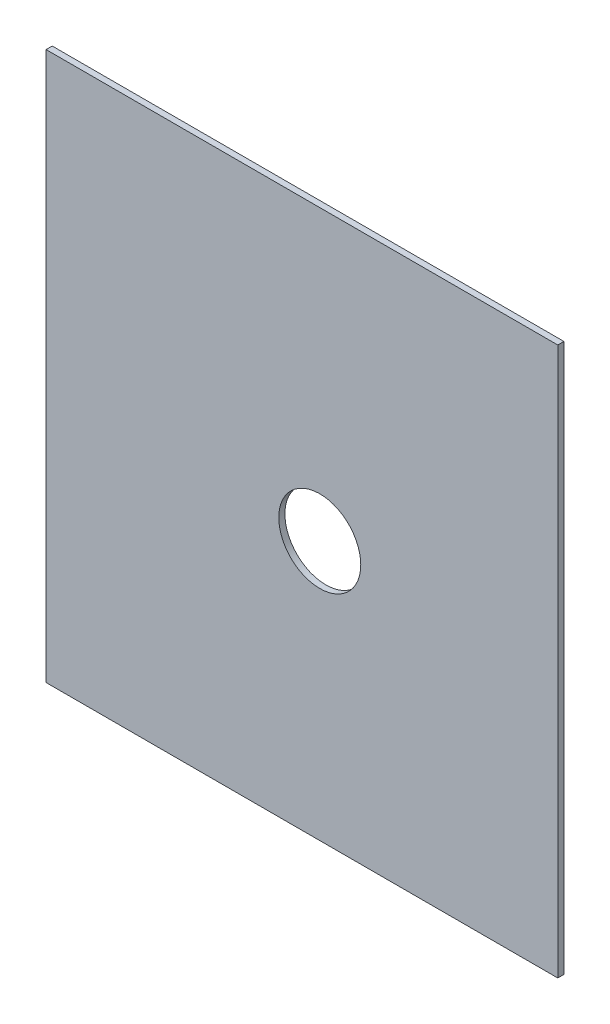
ISO-10303-21;
HEADER;
FILE_DESCRIPTION(('STEP AP214'),'2;1');
FILE_NAME('part.step','',(''),(''),'','','');
FILE_SCHEMA(('AUTOMOTIVE_DESIGN { 1 0 10303 214 1 1 1 1 }'));
ENDSEC;
DATA;
#1=APPLICATION_CONTEXT('core data for automotive mechanical design processes');
#2=APPLICATION_PROTOCOL_DEFINITION('international standard','automotive_design',2000,#1);
#3=PRODUCT_CONTEXT('',#1,'mechanical');
#4=PRODUCT('Part','Part','',(#3));
#5=PRODUCT_RELATED_PRODUCT_CATEGORY('part','',(#4));
#6=PRODUCT_DEFINITION_FORMATION('','',#4);
#7=PRODUCT_DEFINITION_CONTEXT('part definition',#1,'design');
#8=PRODUCT_DEFINITION('design','',#6,#7);
#9=PRODUCT_DEFINITION_SHAPE('','',#8);
#10=(LENGTH_UNIT() NAMED_UNIT(*) SI_UNIT(.MILLI.,.METRE.));
#11=(NAMED_UNIT(*) PLANE_ANGLE_UNIT() SI_UNIT($,.RADIAN.));
#12=(NAMED_UNIT(*) SI_UNIT($,.STERADIAN.) SOLID_ANGLE_UNIT());
#13=UNCERTAINTY_MEASURE_WITH_UNIT(LENGTH_MEASURE(1.E-05),#10,'distance_accuracy_value','');
#14=(GEOMETRIC_REPRESENTATION_CONTEXT(3) GLOBAL_UNCERTAINTY_ASSIGNED_CONTEXT((#13)) GLOBAL_UNIT_ASSIGNED_CONTEXT((#10,
#11,#12)) REPRESENTATION_CONTEXT('',''));
#15=CARTESIAN_POINT('',(0.,0.,0.));
#16=DIRECTION('',(0.,0.,1.));
#17=DIRECTION('',(1.,0.,0.));
#18=AXIS2_PLACEMENT_3D('',#15,#16,#17);
#19=CARTESIAN_POINT('',(0.,0.,3.));
#20=DIRECTION('',(1.,0.,0.));
#21=DIRECTION('',(0.,1.,0.));
#22=AXIS2_PLACEMENT_3D('',#19,#20,#21);
#23=PLANE('',#22);
#24=DIRECTION('',(0.,-1.,0.));
#25=VECTOR('',#24,1.);
#26=CARTESIAN_POINT('',(0.,0.,0.));
#27=LINE('',#26,#25);
#28=CARTESIAN_POINT('',(0.,0.,0.));
#29=VERTEX_POINT('',#28);
#30=CARTESIAN_POINT('',(0.,-267.4,0.));
#31=VERTEX_POINT('',#30);
#32=EDGE_CURVE('E96',#29,#31,#27,.T.);
#33=ORIENTED_EDGE('',*,*,#32,.T.);
#34=DIRECTION('',(0.,0.,-1.));
#35=VECTOR('',#34,1.);
#36=CARTESIAN_POINT('',(0.,-267.4,3.));
#37=LINE('',#36,#35);
#38=CARTESIAN_POINT('',(0.,-267.4,3.));
#39=VERTEX_POINT('',#38);
#40=EDGE_CURVE('E11',#39,#31,#37,.T.);
#41=ORIENTED_EDGE('',*,*,#40,.F.);
#42=DIRECTION('',(0.,-1.,0.));
#43=VECTOR('',#42,1.);
#44=CARTESIAN_POINT('',(0.,0.,3.));
#45=LINE('',#44,#43);
#46=CARTESIAN_POINT('',(0.,0.,3.));
#47=VERTEX_POINT('',#46);
#48=EDGE_CURVE('E84',#47,#39,#45,.T.);
#49=ORIENTED_EDGE('',*,*,#48,.F.);
#50=DIRECTION('',(0.,0.,-1.));
#51=VECTOR('',#50,1.);
#52=CARTESIAN_POINT('',(0.,0.,3.));
#53=LINE('',#52,#51);
#54=EDGE_CURVE('E92',#47,#29,#53,.T.);
#55=ORIENTED_EDGE('',*,*,#54,.T.);
#56=EDGE_LOOP('',(#33,#41,#49,#55));
#57=FACE_BOUND('',#56,.T.);
#58=ADVANCED_FACE('F33',(#57),#23,.F.);
#59=CARTESIAN_POINT('',(0.,-267.4,3.));
#60=DIRECTION('',(0.,1.,0.));
#61=DIRECTION('',(0.,0.,1.));
#62=AXIS2_PLACEMENT_3D('',#59,#60,#61);
#63=PLANE('',#62);
#64=DIRECTION('',(1.,0.,0.));
#65=VECTOR('',#64,1.);
#66=CARTESIAN_POINT('',(0.,-267.4,0.));
#67=LINE('',#66,#65);
#68=CARTESIAN_POINT('',(249.6,-267.4,0.));
#69=VERTEX_POINT('',#68);
#70=EDGE_CURVE('E88',#31,#69,#67,.T.);
#71=ORIENTED_EDGE('',*,*,#70,.T.);
#72=DIRECTION('',(0.,0.,-1.));
#73=VECTOR('',#72,1.);
#74=CARTESIAN_POINT('',(249.6,-267.4,3.));
#75=LINE('',#74,#73);
#76=CARTESIAN_POINT('',(249.6,-267.4,3.));
#77=VERTEX_POINT('',#76);
#78=EDGE_CURVE('E41',#77,#69,#75,.T.);
#79=ORIENTED_EDGE('',*,*,#78,.F.);
#80=DIRECTION('',(1.,0.,0.));
#81=VECTOR('',#80,1.);
#82=CARTESIAN_POINT('',(0.,-267.4,3.));
#83=LINE('',#82,#81);
#84=EDGE_CURVE('E79',#39,#77,#83,.T.);
#85=ORIENTED_EDGE('',*,*,#84,.F.);
#86=ORIENTED_EDGE('',*,*,#40,.T.);
#87=EDGE_LOOP('',(#71,#79,#85,#86));
#88=FACE_BOUND('',#87,.T.);
#89=ADVANCED_FACE('F87',(#88),#63,.F.);
#90=CARTESIAN_POINT('',(249.6,0.,3.));
#91=DIRECTION('',(-1.,0.,0.));
#92=DIRECTION('',(0.,-1.,0.));
#93=AXIS2_PLACEMENT_3D('',#90,#91,#92);
#94=PLANE('',#93);
#95=DIRECTION('',(0.,1.,0.));
#96=VECTOR('',#95,1.);
#97=CARTESIAN_POINT('',(249.6,0.,0.));
#98=LINE('',#97,#96);
#99=CARTESIAN_POINT('',(249.6,0.,0.));
#100=VERTEX_POINT('',#99);
#101=EDGE_CURVE('E66',#69,#100,#98,.T.);
#102=ORIENTED_EDGE('',*,*,#101,.T.);
#103=DIRECTION('',(0.,0.,-1.));
#104=VECTOR('',#103,1.);
#105=CARTESIAN_POINT('',(249.6,0.,3.));
#106=LINE('',#105,#104);
#107=CARTESIAN_POINT('',(249.6,0.,3.));
#108=VERTEX_POINT('',#107);
#109=EDGE_CURVE('E89',#108,#100,#106,.T.);
#110=ORIENTED_EDGE('',*,*,#109,.F.);
#111=DIRECTION('',(0.,1.,0.));
#112=VECTOR('',#111,1.);
#113=CARTESIAN_POINT('',(249.6,0.,3.));
#114=LINE('',#113,#112);
#115=EDGE_CURVE('E82',#77,#108,#114,.T.);
#116=ORIENTED_EDGE('',*,*,#115,.F.);
#117=ORIENTED_EDGE('',*,*,#78,.T.);
#118=EDGE_LOOP('',(#102,#110,#116,#117));
#119=FACE_BOUND('',#118,.T.);
#120=ADVANCED_FACE('F90',(#119),#94,.F.);
#121=CARTESIAN_POINT('',(0.,0.,3.));
#122=DIRECTION('',(0.,-1.,0.));
#123=DIRECTION('',(0.,0.,-1.));
#124=AXIS2_PLACEMENT_3D('',#121,#122,#123);
#125=PLANE('',#124);
#126=DIRECTION('',(-1.,0.,0.));
#127=VECTOR('',#126,1.);
#128=CARTESIAN_POINT('',(0.,0.,0.));
#129=LINE('',#128,#127);
#130=EDGE_CURVE('E72',#100,#29,#129,.T.);
#131=ORIENTED_EDGE('',*,*,#130,.T.);
#132=ORIENTED_EDGE('',*,*,#54,.F.);
#133=DIRECTION('',(-1.,0.,0.));
#134=VECTOR('',#133,1.);
#135=CARTESIAN_POINT('',(0.,0.,3.));
#136=LINE('',#135,#134);
#137=EDGE_CURVE('E49',#108,#47,#136,.T.);
#138=ORIENTED_EDGE('',*,*,#137,.F.);
#139=ORIENTED_EDGE('',*,*,#109,.T.);
#140=EDGE_LOOP('',(#131,#132,#138,#139));
#141=FACE_BOUND('',#140,.T.);
#142=ADVANCED_FACE('F104',(#141),#125,.F.);
#143=CARTESIAN_POINT('',(0.,0.,3.));
#144=DIRECTION('',(0.,0.,1.));
#145=DIRECTION('',(1.,0.,0.));
#146=AXIS2_PLACEMENT_3D('',#143,#144,#145);
#147=PLANE('',#146);
#148=CARTESIAN_POINT('',(133.5,-140.910978413468,3.));
#149=DIRECTION('',(0.,0.,1.));
#150=DIRECTION('',(1.,0.,0.));
#151=AXIS2_PLACEMENT_3D('',#148,#149,#150);
#152=CIRCLE('',#151,20.);
#153=CARTESIAN_POINT('',(153.5,-140.910978413468,3.));
#154=VERTEX_POINT('',#153);
#155=EDGE_CURVE('E110',#154,#154,#152,.T.);
#156=ORIENTED_EDGE('',*,*,#155,.F.);
#157=EDGE_LOOP('',(#156));
#158=FACE_BOUND('',#157,.T.);
#159=ORIENTED_EDGE('',*,*,#48,.T.);
#160=ORIENTED_EDGE('',*,*,#84,.T.);
#161=ORIENTED_EDGE('',*,*,#115,.T.);
#162=ORIENTED_EDGE('',*,*,#137,.T.);
#163=EDGE_LOOP('',(#159,#160,#161,#162));
#164=FACE_BOUND('',#163,.T.);
#165=ADVANCED_FACE('F80',(#158,#164),#147,.T.);
#166=CARTESIAN_POINT('',(0.,0.,0.));
#167=DIRECTION('',(0.,0.,1.));
#168=DIRECTION('',(1.,0.,0.));
#169=AXIS2_PLACEMENT_3D('',#166,#167,#168);
#170=PLANE('',#169);
#171=CARTESIAN_POINT('',(133.5,-140.910978413468,0.));
#172=DIRECTION('',(0.,0.,1.));
#173=DIRECTION('',(1.,0.,0.));
#174=AXIS2_PLACEMENT_3D('',#171,#172,#173);
#175=CIRCLE('',#174,20.);
#176=CARTESIAN_POINT('',(153.5,-140.910978413468,0.));
#177=VERTEX_POINT('',#176);
#178=EDGE_CURVE('E99',#177,#177,#175,.T.);
#179=ORIENTED_EDGE('',*,*,#178,.T.);
#180=EDGE_LOOP('',(#179));
#181=FACE_BOUND('',#180,.T.);
#182=ORIENTED_EDGE('',*,*,#32,.F.);
#183=ORIENTED_EDGE('',*,*,#130,.F.);
#184=ORIENTED_EDGE('',*,*,#101,.F.);
#185=ORIENTED_EDGE('',*,*,#70,.F.);
#186=EDGE_LOOP('',(#182,#183,#184,#185));
#187=FACE_BOUND('',#186,.T.);
#188=ADVANCED_FACE('F107',(#181,#187),#170,.F.);
#189=CARTESIAN_POINT('',(133.5,-140.910978413468,0.));
#190=DIRECTION('',(0.,0.,1.));
#191=DIRECTION('',(1.,0.,0.));
#192=AXIS2_PLACEMENT_3D('',#189,#190,#191);
#193=CYLINDRICAL_SURFACE('',#192,20.);
#194=ORIENTED_EDGE('',*,*,#178,.F.);
#195=EDGE_LOOP('',(#194));
#196=FACE_BOUND('',#195,.T.);
#197=ORIENTED_EDGE('',*,*,#155,.T.);
#198=EDGE_LOOP('',(#197));
#199=FACE_BOUND('',#198,.T.);
#200=ADVANCED_FACE('F117',(#196,#199),#193,.F.);
#201=CLOSED_SHELL('',(#58,#89,#120,#142,#165,#188,#200));
#202=MANIFOLD_SOLID_BREP('B2',#201);
#203=ADVANCED_BREP_SHAPE_REPRESENTATION('',(#18,#202),#14);
#204=SHAPE_DEFINITION_REPRESENTATION(#9,#203);
ENDSEC;
END-ISO-10303-21;
